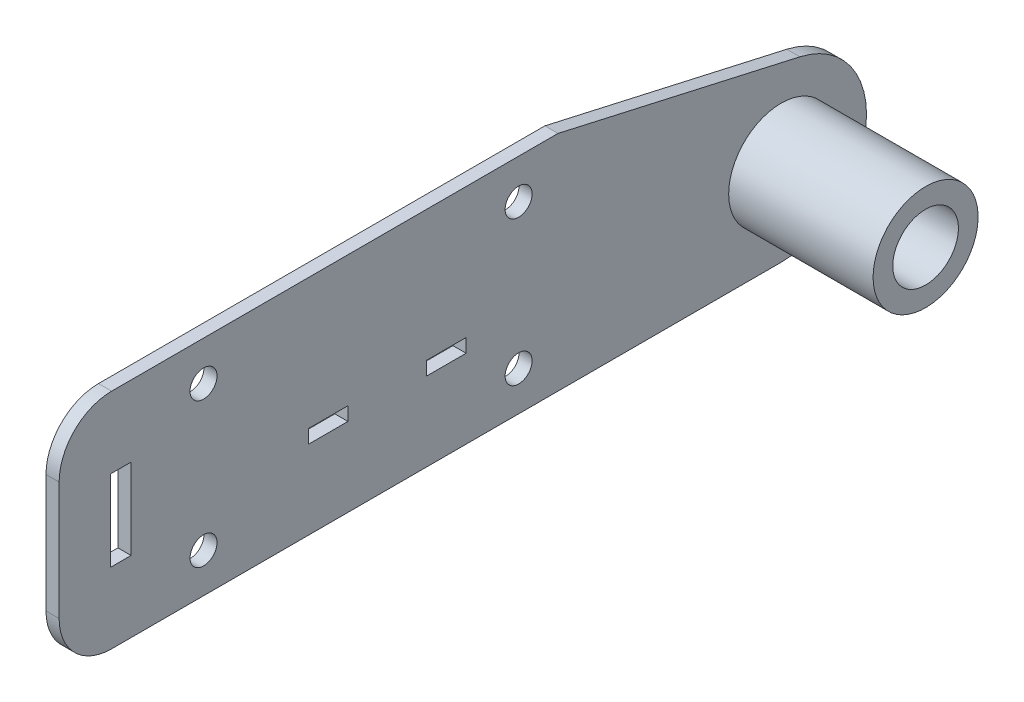
ISO-10303-21;
HEADER;
FILE_DESCRIPTION(('STEP AP214'),'2;1');
FILE_NAME('part.step','',(''),(''),'','','');
FILE_SCHEMA(('AUTOMOTIVE_DESIGN { 1 0 10303 214 1 1 1 1 }'));
ENDSEC;
DATA;
#1=APPLICATION_CONTEXT('core data for automotive mechanical design processes');
#2=APPLICATION_PROTOCOL_DEFINITION('international standard','automotive_design',2000,#1);
#3=PRODUCT_CONTEXT('',#1,'mechanical');
#4=PRODUCT('Part','Part','',(#3));
#5=PRODUCT_RELATED_PRODUCT_CATEGORY('part','',(#4));
#6=PRODUCT_DEFINITION_FORMATION('','',#4);
#7=PRODUCT_DEFINITION_CONTEXT('part definition',#1,'design');
#8=PRODUCT_DEFINITION('design','',#6,#7);
#9=PRODUCT_DEFINITION_SHAPE('','',#8);
#10=(LENGTH_UNIT() NAMED_UNIT(*) SI_UNIT(.MILLI.,.METRE.));
#11=(NAMED_UNIT(*) PLANE_ANGLE_UNIT() SI_UNIT($,.RADIAN.));
#12=(NAMED_UNIT(*) SI_UNIT($,.STERADIAN.) SOLID_ANGLE_UNIT());
#13=UNCERTAINTY_MEASURE_WITH_UNIT(LENGTH_MEASURE(1.E-05),#10,'distance_accuracy_value','');
#14=(GEOMETRIC_REPRESENTATION_CONTEXT(3) GLOBAL_UNCERTAINTY_ASSIGNED_CONTEXT((#13)) GLOBAL_UNIT_ASSIGNED_CONTEXT((#10,
#11,#12)) REPRESENTATION_CONTEXT('',''));
#15=CARTESIAN_POINT('',(0.,0.,0.));
#16=DIRECTION('',(0.,0.,1.));
#17=DIRECTION('',(1.,0.,0.));
#18=AXIS2_PLACEMENT_3D('',#15,#16,#17);
#19=CARTESIAN_POINT('',(3.175,-26.9875,0.));
#20=DIRECTION('',(0.,1.,0.));
#21=DIRECTION('',(0.,0.,1.));
#22=AXIS2_PLACEMENT_3D('',#19,#20,#21);
#23=PLANE('',#22);
#24=DIRECTION('',(0.,0.,-1.));
#25=VECTOR('',#24,1.);
#26=CARTESIAN_POINT('',(0.,-26.9875,0.));
#27=LINE('',#26,#25);
#28=CARTESIAN_POINT('',(0.,-26.9875,60.3249999999999));
#29=VERTEX_POINT('',#28);
#30=CARTESIAN_POINT('',(0.,-26.9875,-101.6));
#31=VERTEX_POINT('',#30);
#32=EDGE_CURVE('E434',#29,#31,#27,.T.);
#33=ORIENTED_EDGE('',*,*,#32,.T.);
#34=DIRECTION('',(-1.,0.,0.));
#35=VECTOR('',#34,1.);
#36=CARTESIAN_POINT('',(3.175,-26.9875,-101.6));
#37=LINE('',#36,#35);
#38=CARTESIAN_POINT('',(3.175,-26.9875,-101.6));
#39=VERTEX_POINT('',#38);
#40=EDGE_CURVE('E11',#39,#31,#37,.T.);
#41=ORIENTED_EDGE('',*,*,#40,.F.);
#42=DIRECTION('',(0.,0.,-1.));
#43=VECTOR('',#42,1.);
#44=CARTESIAN_POINT('',(3.175,-26.9875,0.));
#45=LINE('',#44,#43);
#46=CARTESIAN_POINT('',(3.175,-26.9875,60.3249999999999));
#47=VERTEX_POINT('',#46);
#48=EDGE_CURVE('E400',#47,#39,#45,.T.);
#49=ORIENTED_EDGE('',*,*,#48,.F.);
#50=DIRECTION('',(1.,0.,0.));
#51=VECTOR('',#50,1.);
#52=CARTESIAN_POINT('',(-59.6528341740776,-26.9875,60.3249999999999));
#53=LINE('',#52,#51);
#54=EDGE_CURVE('E361',#29,#47,#53,.T.);
#55=ORIENTED_EDGE('',*,*,#54,.F.);
#56=EDGE_LOOP('',(#33,#41,#49,#55));
#57=FACE_BOUND('',#56,.T.);
#58=ADVANCED_FACE('F44',(#57),#23,.F.);
#59=CARTESIAN_POINT('',(3.175,-6.35,-101.6));
#60=DIRECTION('',(-1.,0.,0.));
#61=DIRECTION('',(0.,0.,1.));
#62=AXIS2_PLACEMENT_3D('',#59,#60,#61);
#63=CYLINDRICAL_SURFACE('',#62,20.6375);
#64=CARTESIAN_POINT('',(0.,-6.35,-101.6));
#65=DIRECTION('',(1.,0.,0.));
#66=DIRECTION('',(0.,0.,-1.));
#67=AXIS2_PLACEMENT_3D('',#64,#65,#66);
#68=CIRCLE('',#67,20.6375);
#69=CARTESIAN_POINT('',(0.,13.7812178866127,-106.143178694673));
#70=VERTEX_POINT('',#69);
#71=EDGE_CURVE('E438',#31,#70,#68,.T.);
#72=ORIENTED_EDGE('',*,*,#71,.T.);
#73=DIRECTION('',(-1.,0.,0.));
#74=VECTOR('',#73,1.);
#75=CARTESIAN_POINT('',(3.175,13.7812178866127,-106.143178694673));
#76=LINE('',#75,#74);
#77=CARTESIAN_POINT('',(3.175,13.7812178866127,-106.143178694673));
#78=VERTEX_POINT('',#77);
#79=EDGE_CURVE('E53',#78,#70,#76,.T.);
#80=ORIENTED_EDGE('',*,*,#79,.F.);
#81=CARTESIAN_POINT('',(3.175,-6.35,-101.6));
#82=DIRECTION('',(1.,0.,0.));
#83=DIRECTION('',(0.,0.,-1.));
#84=AXIS2_PLACEMENT_3D('',#81,#82,#83);
#85=CIRCLE('',#84,20.6375);
#86=EDGE_CURVE('E404',#39,#78,#85,.T.);
#87=ORIENTED_EDGE('',*,*,#86,.F.);
#88=ORIENTED_EDGE('',*,*,#40,.T.);
#89=EDGE_LOOP('',(#72,#80,#87,#88));
#90=FACE_BOUND('',#89,.T.);
#91=ADVANCED_FACE('F456',(#90),#63,.T.);
#92=CARTESIAN_POINT('',(3.175,35.9066765211899,-8.10335711859988));
#93=DIRECTION('',(0.,0.97546785640764,-0.220141911310601));
#94=DIRECTION('',(0.,0.220141911310601,0.97546785640764));
#95=AXIS2_PLACEMENT_3D('',#92,#93,#94);
#96=PLANE('',#95);
#97=DIRECTION('',(0.,-0.220141911310601,-0.97546785640764));
#98=VECTOR('',#97,1.);
#99=CARTESIAN_POINT('',(0.,35.9066765211899,-8.10335711859988));
#100=LINE('',#99,#98);
#101=CARTESIAN_POINT('',(0.,26.9875,-47.625));
#102=VERTEX_POINT('',#101);
#103=EDGE_CURVE('E442',#102,#70,#100,.T.);
#104=ORIENTED_EDGE('',*,*,#103,.F.);
#105=DIRECTION('',(-1.,0.,0.));
#106=VECTOR('',#105,1.);
#107=CARTESIAN_POINT('',(3.175,26.9875,-47.625));
#108=LINE('',#107,#106);
#109=CARTESIAN_POINT('',(3.175,26.9875,-47.625));
#110=VERTEX_POINT('',#109);
#111=EDGE_CURVE('E419',#110,#102,#108,.T.);
#112=ORIENTED_EDGE('',*,*,#111,.F.);
#113=DIRECTION('',(0.,-0.220141911310601,-0.97546785640764));
#114=VECTOR('',#113,1.);
#115=CARTESIAN_POINT('',(3.175,35.9066765211899,-8.10335711859988));
#116=LINE('',#115,#114);
#117=EDGE_CURVE('E407',#110,#78,#116,.T.);
#118=ORIENTED_EDGE('',*,*,#117,.T.);
#119=ORIENTED_EDGE('',*,*,#79,.T.);
#120=EDGE_LOOP('',(#104,#112,#118,#119));
#121=FACE_BOUND('',#120,.T.);
#122=ADVANCED_FACE('F453',(#121),#96,.T.);
#123=CARTESIAN_POINT('',(3.175,26.9875,0.));
#124=DIRECTION('',(0.,1.,0.));
#125=DIRECTION('',(0.,0.,1.));
#126=AXIS2_PLACEMENT_3D('',#123,#124,#125);
#127=PLANE('',#126);
#128=DIRECTION('',(0.,0.,-1.));
#129=VECTOR('',#128,1.);
#130=CARTESIAN_POINT('',(0.,26.9875,0.));
#131=LINE('',#130,#129);
#132=CARTESIAN_POINT('',(0.,26.9875,60.3249999999999));
#133=VERTEX_POINT('',#132);
#134=EDGE_CURVE('E389',#133,#102,#131,.T.);
#135=ORIENTED_EDGE('',*,*,#134,.F.);
#136=DIRECTION('',(1.,0.,0.));
#137=VECTOR('',#136,1.);
#138=CARTESIAN_POINT('',(-59.6528341740776,26.9875,60.3249999999999));
#139=LINE('',#138,#137);
#140=CARTESIAN_POINT('',(3.175,26.9875,60.3249999999999));
#141=VERTEX_POINT('',#140);
#142=EDGE_CURVE('E360',#133,#141,#139,.T.);
#143=ORIENTED_EDGE('',*,*,#142,.T.);
#144=DIRECTION('',(0.,0.,-1.));
#145=VECTOR('',#144,1.);
#146=CARTESIAN_POINT('',(3.175,26.9875,0.));
#147=LINE('',#146,#145);
#148=EDGE_CURVE('E411',#141,#110,#147,.T.);
#149=ORIENTED_EDGE('',*,*,#148,.T.);
#150=ORIENTED_EDGE('',*,*,#111,.T.);
#151=EDGE_LOOP('',(#135,#143,#149,#150));
#152=FACE_BOUND('',#151,.T.);
#153=ADVANCED_FACE('F463',(#152),#127,.T.);
#154=CARTESIAN_POINT('',(3.175,17.4625,38.1));
#155=DIRECTION('',(-1.,0.,0.));
#156=DIRECTION('',(0.,0.,1.));
#157=AXIS2_PLACEMENT_3D('',#154,#155,#156);
#158=CYLINDRICAL_SURFACE('',#157,3.2639);
#159=CARTESIAN_POINT('',(3.175,17.4625,38.1));
#160=DIRECTION('',(1.,0.,0.));
#161=DIRECTION('',(0.,0.,-1.));
#162=AXIS2_PLACEMENT_3D('',#159,#160,#161);
#163=CIRCLE('',#162,3.2639);
#164=CARTESIAN_POINT('',(3.175,17.4625,34.8361));
#165=VERTEX_POINT('',#164);
#166=EDGE_CURVE('E396',#165,#165,#163,.T.);
#167=ORIENTED_EDGE('',*,*,#166,.T.);
#168=EDGE_LOOP('',(#167));
#169=FACE_BOUND('',#168,.T.);
#170=CARTESIAN_POINT('',(0.,17.4625,38.1));
#171=DIRECTION('',(1.,0.,0.));
#172=DIRECTION('',(0.,0.,-1.));
#173=AXIS2_PLACEMENT_3D('',#170,#171,#172);
#174=CIRCLE('',#173,3.2639);
#175=CARTESIAN_POINT('',(0.,17.4625,34.8361));
#176=VERTEX_POINT('',#175);
#177=EDGE_CURVE('E430',#176,#176,#174,.T.);
#178=ORIENTED_EDGE('',*,*,#177,.F.);
#179=EDGE_LOOP('',(#178));
#180=FACE_BOUND('',#179,.T.);
#181=ADVANCED_FACE('F501',(#169,#180),#158,.F.);
#182=CARTESIAN_POINT('',(3.175,17.4625,-38.1));
#183=DIRECTION('',(-1.,0.,0.));
#184=DIRECTION('',(0.,0.,1.));
#185=AXIS2_PLACEMENT_3D('',#182,#183,#184);
#186=CYLINDRICAL_SURFACE('',#185,3.2639);
#187=CARTESIAN_POINT('',(3.175,17.4625,-38.1));
#188=DIRECTION('',(1.,0.,0.));
#189=DIRECTION('',(0.,0.,-1.));
#190=AXIS2_PLACEMENT_3D('',#187,#188,#189);
#191=CIRCLE('',#190,3.2639);
#192=CARTESIAN_POINT('',(3.175,17.4625,-41.3639));
#193=VERTEX_POINT('',#192);
#194=EDGE_CURVE('E392',#193,#193,#191,.T.);
#195=ORIENTED_EDGE('',*,*,#194,.T.);
#196=EDGE_LOOP('',(#195));
#197=FACE_BOUND('',#196,.T.);
#198=CARTESIAN_POINT('',(0.,17.4625,-38.1));
#199=DIRECTION('',(1.,0.,0.));
#200=DIRECTION('',(0.,0.,-1.));
#201=AXIS2_PLACEMENT_3D('',#198,#199,#200);
#202=CIRCLE('',#201,3.2639);
#203=CARTESIAN_POINT('',(0.,17.4625,-41.3639));
#204=VERTEX_POINT('',#203);
#205=EDGE_CURVE('E426',#204,#204,#202,.T.);
#206=ORIENTED_EDGE('',*,*,#205,.F.);
#207=EDGE_LOOP('',(#206));
#208=FACE_BOUND('',#207,.T.);
#209=ADVANCED_FACE('F504',(#197,#208),#186,.F.);
#210=CARTESIAN_POINT('',(3.175,-17.4625,38.1));
#211=DIRECTION('',(-1.,0.,0.));
#212=DIRECTION('',(0.,0.,1.));
#213=AXIS2_PLACEMENT_3D('',#210,#211,#212);
#214=CYLINDRICAL_SURFACE('',#213,3.2639);
#215=CARTESIAN_POINT('',(3.175,-17.4625,38.1));
#216=DIRECTION('',(1.,0.,0.));
#217=DIRECTION('',(0.,0.,-1.));
#218=AXIS2_PLACEMENT_3D('',#215,#216,#217);
#219=CIRCLE('',#218,3.2639);
#220=CARTESIAN_POINT('',(3.175,-17.4625,34.8361));
#221=VERTEX_POINT('',#220);
#222=EDGE_CURVE('E388',#221,#221,#219,.T.);
#223=ORIENTED_EDGE('',*,*,#222,.T.);
#224=EDGE_LOOP('',(#223));
#225=FACE_BOUND('',#224,.T.);
#226=CARTESIAN_POINT('',(0.,-17.4625,38.1));
#227=DIRECTION('',(1.,0.,0.));
#228=DIRECTION('',(0.,0.,-1.));
#229=AXIS2_PLACEMENT_3D('',#226,#227,#228);
#230=CIRCLE('',#229,3.2639);
#231=CARTESIAN_POINT('',(0.,-17.4625,34.8361));
#232=VERTEX_POINT('',#231);
#233=EDGE_CURVE('E423',#232,#232,#230,.T.);
#234=ORIENTED_EDGE('',*,*,#233,.F.);
#235=EDGE_LOOP('',(#234));
#236=FACE_BOUND('',#235,.T.);
#237=ADVANCED_FACE('F507',(#225,#236),#214,.F.);
#238=CARTESIAN_POINT('',(3.175,-17.4625,-38.1));
#239=DIRECTION('',(-1.,0.,0.));
#240=DIRECTION('',(0.,0.,1.));
#241=AXIS2_PLACEMENT_3D('',#238,#239,#240);
#242=CYLINDRICAL_SURFACE('',#241,3.2639);
#243=CARTESIAN_POINT('',(3.175,-17.4625,-38.1));
#244=DIRECTION('',(1.,0.,0.));
#245=DIRECTION('',(0.,0.,-1.));
#246=AXIS2_PLACEMENT_3D('',#243,#244,#245);
#247=CIRCLE('',#246,3.2639);
#248=CARTESIAN_POINT('',(3.175,-17.4625,-41.3639));
#249=VERTEX_POINT('',#248);
#250=EDGE_CURVE('E384',#249,#249,#247,.T.);
#251=ORIENTED_EDGE('',*,*,#250,.T.);
#252=EDGE_LOOP('',(#251));
#253=FACE_BOUND('',#252,.T.);
#254=CARTESIAN_POINT('',(0.,-17.4625,-38.1));
#255=DIRECTION('',(1.,0.,0.));
#256=DIRECTION('',(0.,0.,-1.));
#257=AXIS2_PLACEMENT_3D('',#254,#255,#256);
#258=CIRCLE('',#257,3.2639);
#259=CARTESIAN_POINT('',(0.,-17.4625,-41.3639));
#260=VERTEX_POINT('',#259);
#261=EDGE_CURVE('E383',#260,#260,#258,.T.);
#262=ORIENTED_EDGE('',*,*,#261,.F.);
#263=EDGE_LOOP('',(#262));
#264=FACE_BOUND('',#263,.T.);
#265=ADVANCED_FACE('F46',(#253,#264),#242,.F.);
#266=CARTESIAN_POINT('',(3.175,0.,0.));
#267=DIRECTION('',(1.,0.,0.));
#268=DIRECTION('',(0.,0.,-1.));
#269=AXIS2_PLACEMENT_3D('',#266,#267,#268);
#270=PLANE('',#269);
#271=DIRECTION('',(0.,-1.,0.));
#272=VECTOR('',#271,1.);
#273=CARTESIAN_POINT('',(3.175,-4.6355,12.7));
#274=LINE('',#273,#272);
#275=CARTESIAN_POINT('',(3.175,-4.6355,12.7));
#276=VERTEX_POINT('',#275);
#277=CARTESIAN_POINT('',(3.175,-7.9375,12.7));
#278=VERTEX_POINT('',#277);
#279=EDGE_CURVE('E63',#276,#278,#274,.T.);
#280=ORIENTED_EDGE('',*,*,#279,.F.);
#281=DIRECTION('',(0.,0.,1.));
#282=VECTOR('',#281,1.);
#283=CARTESIAN_POINT('',(3.175,-4.6355,12.7));
#284=LINE('',#283,#282);
#285=CARTESIAN_POINT('',(3.175,-4.6355,3.175));
#286=VERTEX_POINT('',#285);
#287=EDGE_CURVE('E227',#286,#276,#284,.T.);
#288=ORIENTED_EDGE('',*,*,#287,.F.);
#289=DIRECTION('',(0.,1.,0.));
#290=VECTOR('',#289,1.);
#291=CARTESIAN_POINT('',(3.175,-4.6355,3.175));
#292=LINE('',#291,#290);
#293=CARTESIAN_POINT('',(3.175,-7.9375,3.175));
#294=VERTEX_POINT('',#293);
#295=EDGE_CURVE('E233',#294,#286,#292,.T.);
#296=ORIENTED_EDGE('',*,*,#295,.F.);
#297=DIRECTION('',(0.,0.,-1.));
#298=VECTOR('',#297,1.);
#299=CARTESIAN_POINT('',(3.175,-7.9375,12.7));
#300=LINE('',#299,#298);
#301=EDGE_CURVE('E241',#278,#294,#300,.T.);
#302=ORIENTED_EDGE('',*,*,#301,.F.);
#303=EDGE_LOOP('',(#280,#288,#296,#302));
#304=FACE_BOUND('',#303,.T.);
#305=DIRECTION('',(0.,-1.,0.));
#306=VECTOR('',#305,1.);
#307=CARTESIAN_POINT('',(3.175,-4.6355,-15.875));
#308=LINE('',#307,#306);
#309=CARTESIAN_POINT('',(3.175,-4.6355,-15.875));
#310=VERTEX_POINT('',#309);
#311=CARTESIAN_POINT('',(3.175,-7.9375,-15.875));
#312=VERTEX_POINT('',#311);
#313=EDGE_CURVE('E249',#310,#312,#308,.T.);
#314=ORIENTED_EDGE('',*,*,#313,.F.);
#315=DIRECTION('',(0.,0.,1.));
#316=VECTOR('',#315,1.);
#317=CARTESIAN_POINT('',(3.175,-4.6355,-15.875));
#318=LINE('',#317,#316);
#319=CARTESIAN_POINT('',(3.175,-4.6355,-25.4));
#320=VERTEX_POINT('',#319);
#321=EDGE_CURVE('E260',#320,#310,#318,.T.);
#322=ORIENTED_EDGE('',*,*,#321,.F.);
#323=DIRECTION('',(0.,1.,0.));
#324=VECTOR('',#323,1.);
#325=CARTESIAN_POINT('',(3.175,-4.6355,-25.4));
#326=LINE('',#325,#324);
#327=CARTESIAN_POINT('',(3.175,-7.9375,-25.4));
#328=VERTEX_POINT('',#327);
#329=EDGE_CURVE('E279',#328,#320,#326,.T.);
#330=ORIENTED_EDGE('',*,*,#329,.F.);
#331=DIRECTION('',(0.,0.,-1.));
#332=VECTOR('',#331,1.);
#333=CARTESIAN_POINT('',(3.175,-7.9375,-15.875));
#334=LINE('',#333,#332);
#335=EDGE_CURVE('E275',#312,#328,#334,.T.);
#336=ORIENTED_EDGE('',*,*,#335,.F.);
#337=EDGE_LOOP('',(#314,#322,#330,#336));
#338=FACE_BOUND('',#337,.T.);
#339=ORIENTED_EDGE('',*,*,#250,.F.);
#340=EDGE_LOOP('',(#339));
#341=FACE_BOUND('',#340,.T.);
#342=ORIENTED_EDGE('',*,*,#222,.F.);
#343=EDGE_LOOP('',(#342));
#344=FACE_BOUND('',#343,.T.);
#345=ORIENTED_EDGE('',*,*,#194,.F.);
#346=EDGE_LOOP('',(#345));
#347=FACE_BOUND('',#346,.T.);
#348=ORIENTED_EDGE('',*,*,#166,.F.);
#349=EDGE_LOOP('',(#348));
#350=FACE_BOUND('',#349,.T.);
#351=ORIENTED_EDGE('',*,*,#48,.T.);
#352=ORIENTED_EDGE('',*,*,#86,.T.);
#353=ORIENTED_EDGE('',*,*,#117,.F.);
#354=ORIENTED_EDGE('',*,*,#148,.F.);
#355=CARTESIAN_POINT('',(3.175,14.2875,60.325));
#356=DIRECTION('',(1.,0.,0.));
#357=DIRECTION('',(0.,0.,-1.));
#358=AXIS2_PLACEMENT_3D('',#355,#356,#357);
#359=CIRCLE('',#358,12.7);
#360=CARTESIAN_POINT('',(3.175,14.2874999999999,73.025));
#361=VERTEX_POINT('',#360);
#362=EDGE_CURVE('E341',#141,#361,#359,.T.);
#363=ORIENTED_EDGE('',*,*,#362,.T.);
#364=DIRECTION('',(0.,-1.,0.));
#365=VECTOR('',#364,1.);
#366=CARTESIAN_POINT('',(3.175,14.2874999999999,73.025));
#367=LINE('',#366,#365);
#368=CARTESIAN_POINT('',(3.175,-14.2874999999999,73.025));
#369=VERTEX_POINT('',#368);
#370=EDGE_CURVE('E353',#361,#369,#367,.T.);
#371=ORIENTED_EDGE('',*,*,#370,.T.);
#372=CARTESIAN_POINT('',(3.175,-14.2875,60.325));
#373=DIRECTION('',(1.,0.,0.));
#374=DIRECTION('',(0.,0.,1.));
#375=AXIS2_PLACEMENT_3D('',#372,#373,#374);
#376=CIRCLE('',#375,12.7);
#377=EDGE_CURVE('E357',#369,#47,#376,.T.);
#378=ORIENTED_EDGE('',*,*,#377,.T.);
#379=EDGE_LOOP('',(#351,#352,#353,#354,#363,#371,#378));
#380=FACE_BOUND('',#379,.T.);
#381=CARTESIAN_POINT('',(3.175,-6.35,-101.6));
#382=DIRECTION('',(1.,0.,0.));
#383=DIRECTION('',(0.,0.,-1.));
#384=AXIS2_PLACEMENT_3D('',#381,#382,#383);
#385=CIRCLE('',#384,12.7);
#386=CARTESIAN_POINT('',(3.175,-6.35,-114.3));
#387=VERTEX_POINT('',#386);
#388=EDGE_CURVE('E415',#387,#387,#385,.T.);
#389=ORIENTED_EDGE('',*,*,#388,.F.);
#390=EDGE_LOOP('',(#389));
#391=FACE_BOUND('',#390,.T.);
#392=DIRECTION('',(0.,0.,-1.));
#393=VECTOR('',#392,1.);
#394=CARTESIAN_POINT('',(3.175,-9.77900000000001,60.579));
#395=LINE('',#394,#393);
#396=CARTESIAN_POINT('',(3.175,-9.77900000000001,60.579));
#397=VERTEX_POINT('',#396);
#398=CARTESIAN_POINT('',(3.175,-9.77900000000001,55.626));
#399=VERTEX_POINT('',#398);
#400=EDGE_CURVE('E325',#397,#399,#395,.T.);
#401=ORIENTED_EDGE('',*,*,#400,.F.);
#402=DIRECTION('',(0.,-1.,0.));
#403=VECTOR('',#402,1.);
#404=CARTESIAN_POINT('',(3.175,9.77899999999999,60.579));
#405=LINE('',#404,#403);
#406=CARTESIAN_POINT('',(3.175,9.77899999999999,60.579));
#407=VERTEX_POINT('',#406);
#408=EDGE_CURVE('E289',#407,#397,#405,.T.);
#409=ORIENTED_EDGE('',*,*,#408,.F.);
#410=DIRECTION('',(0.,0.,1.));
#411=VECTOR('',#410,1.);
#412=CARTESIAN_POINT('',(3.175,9.77899999999999,60.579));
#413=LINE('',#412,#411);
#414=CARTESIAN_POINT('',(3.175,9.77899999999999,55.626));
#415=VERTEX_POINT('',#414);
#416=EDGE_CURVE('E333',#415,#407,#413,.T.);
#417=ORIENTED_EDGE('',*,*,#416,.F.);
#418=DIRECTION('',(0.,1.,0.));
#419=VECTOR('',#418,1.);
#420=CARTESIAN_POINT('',(3.175,9.77899999999999,55.626));
#421=LINE('',#420,#419);
#422=EDGE_CURVE('E329',#399,#415,#421,.T.);
#423=ORIENTED_EDGE('',*,*,#422,.F.);
#424=EDGE_LOOP('',(#401,#409,#417,#423));
#425=FACE_BOUND('',#424,.T.);
#426=ADVANCED_FACE('F466',(#304,#338,#341,#344,#347,#350,#380,#391,#425),#270,.T.);
#427=CARTESIAN_POINT('',(0.,0.,0.));
#428=DIRECTION('',(1.,0.,0.));
#429=DIRECTION('',(0.,0.,-1.));
#430=AXIS2_PLACEMENT_3D('',#427,#428,#429);
#431=PLANE('',#430);
#432=DIRECTION('',(0.,0.,1.));
#433=VECTOR('',#432,1.);
#434=CARTESIAN_POINT('',(0.,-4.6355,12.7));
#435=LINE('',#434,#433);
#436=CARTESIAN_POINT('',(0.,-4.6355,3.175));
#437=VERTEX_POINT('',#436);
#438=CARTESIAN_POINT('',(0.,-4.6355,12.7));
#439=VERTEX_POINT('',#438);
#440=EDGE_CURVE('E215',#437,#439,#435,.T.);
#441=ORIENTED_EDGE('',*,*,#440,.T.);
#442=DIRECTION('',(0.,-1.,0.));
#443=VECTOR('',#442,1.);
#444=CARTESIAN_POINT('',(0.,-4.6355,12.7));
#445=LINE('',#444,#443);
#446=CARTESIAN_POINT('',(0.,-7.9375,12.7));
#447=VERTEX_POINT('',#446);
#448=EDGE_CURVE('E208',#439,#447,#445,.T.);
#449=ORIENTED_EDGE('',*,*,#448,.T.);
#450=DIRECTION('',(0.,0.,-1.));
#451=VECTOR('',#450,1.);
#452=CARTESIAN_POINT('',(0.,-7.9375,12.7));
#453=LINE('',#452,#451);
#454=CARTESIAN_POINT('',(0.,-7.9375,3.175));
#455=VERTEX_POINT('',#454);
#456=EDGE_CURVE('E218',#447,#455,#453,.T.);
#457=ORIENTED_EDGE('',*,*,#456,.T.);
#458=DIRECTION('',(0.,1.,0.));
#459=VECTOR('',#458,1.);
#460=CARTESIAN_POINT('',(0.,-4.6355,3.175));
#461=LINE('',#460,#459);
#462=EDGE_CURVE('E74',#455,#437,#461,.T.);
#463=ORIENTED_EDGE('',*,*,#462,.T.);
#464=EDGE_LOOP('',(#441,#449,#457,#463));
#465=FACE_BOUND('',#464,.T.);
#466=DIRECTION('',(0.,0.,1.));
#467=VECTOR('',#466,1.);
#468=CARTESIAN_POINT('',(0.,-4.6355,-15.875));
#469=LINE('',#468,#467);
#470=CARTESIAN_POINT('',(0.,-4.6355,-25.4));
#471=VERTEX_POINT('',#470);
#472=CARTESIAN_POINT('',(0.,-4.6355,-15.875));
#473=VERTEX_POINT('',#472);
#474=EDGE_CURVE('E268',#471,#473,#469,.T.);
#475=ORIENTED_EDGE('',*,*,#474,.T.);
#476=DIRECTION('',(0.,-1.,0.));
#477=VECTOR('',#476,1.);
#478=CARTESIAN_POINT('',(0.,-4.6355,-15.875));
#479=LINE('',#478,#477);
#480=CARTESIAN_POINT('',(0.,-7.9375,-15.875));
#481=VERTEX_POINT('',#480);
#482=EDGE_CURVE('E255',#473,#481,#479,.T.);
#483=ORIENTED_EDGE('',*,*,#482,.T.);
#484=DIRECTION('',(0.,0.,-1.));
#485=VECTOR('',#484,1.);
#486=CARTESIAN_POINT('',(0.,-7.9375,-15.875));
#487=LINE('',#486,#485);
#488=CARTESIAN_POINT('',(0.,-7.9375,-25.4));
#489=VERTEX_POINT('',#488);
#490=EDGE_CURVE('E259',#481,#489,#487,.T.);
#491=ORIENTED_EDGE('',*,*,#490,.T.);
#492=DIRECTION('',(0.,1.,0.));
#493=VECTOR('',#492,1.);
#494=CARTESIAN_POINT('',(0.,-4.6355,-25.4));
#495=LINE('',#494,#493);
#496=EDGE_CURVE('E264',#489,#471,#495,.T.);
#497=ORIENTED_EDGE('',*,*,#496,.T.);
#498=EDGE_LOOP('',(#475,#483,#491,#497));
#499=FACE_BOUND('',#498,.T.);
#500=ORIENTED_EDGE('',*,*,#261,.T.);
#501=EDGE_LOOP('',(#500));
#502=FACE_BOUND('',#501,.T.);
#503=ORIENTED_EDGE('',*,*,#233,.T.);
#504=EDGE_LOOP('',(#503));
#505=FACE_BOUND('',#504,.T.);
#506=ORIENTED_EDGE('',*,*,#205,.T.);
#507=EDGE_LOOP('',(#506));
#508=FACE_BOUND('',#507,.T.);
#509=ORIENTED_EDGE('',*,*,#177,.T.);
#510=EDGE_LOOP('',(#509));
#511=FACE_BOUND('',#510,.T.);
#512=ORIENTED_EDGE('',*,*,#32,.F.);
#513=CARTESIAN_POINT('',(0.,-14.2875,60.325));
#514=DIRECTION('',(1.,0.,0.));
#515=DIRECTION('',(0.,0.,-1.));
#516=AXIS2_PLACEMENT_3D('',#513,#514,#515);
#517=CIRCLE('',#516,12.7);
#518=CARTESIAN_POINT('',(0.,-14.2874999999999,73.025));
#519=VERTEX_POINT('',#518);
#520=EDGE_CURVE('E312',#29,#519,#517,.F.);
#521=ORIENTED_EDGE('',*,*,#520,.T.);
#522=DIRECTION('',(0.,1.,0.));
#523=VECTOR('',#522,1.);
#524=CARTESIAN_POINT('',(0.,14.2874999999999,73.025));
#525=LINE('',#524,#523);
#526=CARTESIAN_POINT('',(0.,14.2874999999999,73.025));
#527=VERTEX_POINT('',#526);
#528=EDGE_CURVE('E317',#519,#527,#525,.T.);
#529=ORIENTED_EDGE('',*,*,#528,.T.);
#530=CARTESIAN_POINT('',(0.,14.2875,60.325));
#531=DIRECTION('',(1.,0.,0.));
#532=DIRECTION('',(0.,0.,-1.));
#533=AXIS2_PLACEMENT_3D('',#530,#531,#532);
#534=CIRCLE('',#533,12.7);
#535=EDGE_CURVE('E313',#527,#133,#534,.F.);
#536=ORIENTED_EDGE('',*,*,#535,.T.);
#537=ORIENTED_EDGE('',*,*,#134,.T.);
#538=ORIENTED_EDGE('',*,*,#103,.T.);
#539=ORIENTED_EDGE('',*,*,#71,.F.);
#540=EDGE_LOOP('',(#512,#521,#529,#536,#537,#538,#539));
#541=FACE_BOUND('',#540,.T.);
#542=CARTESIAN_POINT('',(0.,-6.35,-101.6));
#543=DIRECTION('',(-1.,0.,0.));
#544=DIRECTION('',(0.,0.,1.));
#545=AXIS2_PLACEMENT_3D('',#542,#543,#544);
#546=CIRCLE('',#545,7.93749999999999);
#547=CARTESIAN_POINT('',(0.,-6.35,-93.6625));
#548=VERTEX_POINT('',#547);
#549=EDGE_CURVE('E303',#548,#548,#546,.T.);
#550=ORIENTED_EDGE('',*,*,#549,.F.);
#551=EDGE_LOOP('',(#550));
#552=FACE_BOUND('',#551,.T.);
#553=DIRECTION('',(0.,0.,1.));
#554=VECTOR('',#553,1.);
#555=CARTESIAN_POINT('',(0.,-9.77900000000001,60.579));
#556=LINE('',#555,#554);
#557=CARTESIAN_POINT('',(0.,-9.77900000000001,55.626));
#558=VERTEX_POINT('',#557);
#559=CARTESIAN_POINT('',(0.,-9.77900000000001,60.579));
#560=VERTEX_POINT('',#559);
#561=EDGE_CURVE('E318',#558,#560,#556,.T.);
#562=ORIENTED_EDGE('',*,*,#561,.F.);
#563=DIRECTION('',(0.,-1.,0.));
#564=VECTOR('',#563,1.);
#565=CARTESIAN_POINT('',(0.,9.77899999999999,55.626));
#566=LINE('',#565,#564);
#567=CARTESIAN_POINT('',(0.,9.77899999999999,55.626));
#568=VERTEX_POINT('',#567);
#569=EDGE_CURVE('E299',#568,#558,#566,.T.);
#570=ORIENTED_EDGE('',*,*,#569,.F.);
#571=DIRECTION('',(0.,0.,-1.));
#572=VECTOR('',#571,1.);
#573=CARTESIAN_POINT('',(0.,9.77899999999999,60.579));
#574=LINE('',#573,#572);
#575=CARTESIAN_POINT('',(0.,9.77899999999999,60.579));
#576=VERTEX_POINT('',#575);
#577=EDGE_CURVE('E304',#576,#568,#574,.T.);
#578=ORIENTED_EDGE('',*,*,#577,.F.);
#579=DIRECTION('',(0.,1.,0.));
#580=VECTOR('',#579,1.);
#581=CARTESIAN_POINT('',(0.,9.77899999999999,60.579));
#582=LINE('',#581,#580);
#583=EDGE_CURVE('E308',#560,#576,#582,.T.);
#584=ORIENTED_EDGE('',*,*,#583,.F.);
#585=EDGE_LOOP('',(#562,#570,#578,#584));
#586=FACE_BOUND('',#585,.T.);
#587=ADVANCED_FACE('F223',(#465,#499,#502,#505,#508,#511,#541,#552,#586),#431,.F.);
#588=CARTESIAN_POINT('',(38.1,-6.35,-101.6));
#589=DIRECTION('',(-1.,0.,0.));
#590=DIRECTION('',(0.,0.,1.));
#591=AXIS2_PLACEMENT_3D('',#588,#589,#590);
#592=CYLINDRICAL_SURFACE('',#591,12.7);
#593=ORIENTED_EDGE('',*,*,#388,.T.);
#594=EDGE_LOOP('',(#593));
#595=FACE_BOUND('',#594,.T.);
#596=CARTESIAN_POINT('',(38.1,-6.35,-101.6));
#597=DIRECTION('',(-1.,0.,0.));
#598=DIRECTION('',(0.,0.,1.));
#599=AXIS2_PLACEMENT_3D('',#596,#597,#598);
#600=CIRCLE('',#599,12.7);
#601=CARTESIAN_POINT('',(38.1,-6.35,-88.9));
#602=VERTEX_POINT('',#601);
#603=EDGE_CURVE('E377',#602,#602,#600,.T.);
#604=ORIENTED_EDGE('',*,*,#603,.T.);
#605=EDGE_LOOP('',(#604));
#606=FACE_BOUND('',#605,.T.);
#607=ADVANCED_FACE('F521',(#595,#606),#592,.T.);
#608=CARTESIAN_POINT('',(38.1,-6.35,-101.6));
#609=DIRECTION('',(-1.,0.,0.));
#610=DIRECTION('',(0.,0.,1.));
#611=AXIS2_PLACEMENT_3D('',#608,#609,#610);
#612=PLANE('',#611);
#613=CARTESIAN_POINT('',(38.1,-6.35,-101.6));
#614=DIRECTION('',(-1.,0.,0.));
#615=DIRECTION('',(0.,0.,1.));
#616=AXIS2_PLACEMENT_3D('',#613,#614,#615);
#617=CIRCLE('',#616,7.93749999999999);
#618=CARTESIAN_POINT('',(38.1,-6.35,-93.6625));
#619=VERTEX_POINT('',#618);
#620=EDGE_CURVE('E374',#619,#619,#617,.T.);
#621=ORIENTED_EDGE('',*,*,#620,.T.);
#622=EDGE_LOOP('',(#621));
#623=FACE_BOUND('',#622,.T.);
#624=ORIENTED_EDGE('',*,*,#603,.F.);
#625=EDGE_LOOP('',(#624));
#626=FACE_BOUND('',#625,.T.);
#627=ADVANCED_FACE('F490',(#623,#626),#612,.F.);
#628=CARTESIAN_POINT('',(38.1,-6.35,-101.6));
#629=DIRECTION('',(-1.,0.,0.));
#630=DIRECTION('',(0.,0.,1.));
#631=AXIS2_PLACEMENT_3D('',#628,#629,#630);
#632=CYLINDRICAL_SURFACE('',#631,7.93749999999999);
#633=ORIENTED_EDGE('',*,*,#620,.F.);
#634=EDGE_LOOP('',(#633));
#635=FACE_BOUND('',#634,.T.);
#636=ORIENTED_EDGE('',*,*,#549,.T.);
#637=EDGE_LOOP('',(#636));
#638=FACE_BOUND('',#637,.T.);
#639=ADVANCED_FACE('F483',(#635,#638),#632,.F.);
#640=CARTESIAN_POINT('',(-59.6528341740776,14.2875,60.325));
#641=DIRECTION('',(1.,0.,0.));
#642=DIRECTION('',(0.,0.,-1.));
#643=AXIS2_PLACEMENT_3D('',#640,#641,#642);
#644=CYLINDRICAL_SURFACE('',#643,12.7);
#645=ORIENTED_EDGE('',*,*,#535,.F.);
#646=DIRECTION('',(1.,0.,0.));
#647=VECTOR('',#646,1.);
#648=CARTESIAN_POINT('',(-59.6528341740776,14.2874999999999,73.025));
#649=LINE('',#648,#647);
#650=EDGE_CURVE('E366',#527,#361,#649,.T.);
#651=ORIENTED_EDGE('',*,*,#650,.T.);
#652=ORIENTED_EDGE('',*,*,#362,.F.);
#653=ORIENTED_EDGE('',*,*,#142,.F.);
#654=EDGE_LOOP('',(#645,#651,#652,#653));
#655=FACE_BOUND('',#654,.T.);
#656=ADVANCED_FACE('F481',(#655),#644,.T.);
#657=CARTESIAN_POINT('',(-59.6528341740776,14.2874999999999,73.025));
#658=DIRECTION('',(0.,0.,1.));
#659=DIRECTION('',(1.,0.,0.));
#660=AXIS2_PLACEMENT_3D('',#657,#658,#659);
#661=PLANE('',#660);
#662=ORIENTED_EDGE('',*,*,#528,.F.);
#663=DIRECTION('',(1.,0.,0.));
#664=VECTOR('',#663,1.);
#665=CARTESIAN_POINT('',(-59.6528341740776,-14.2874999999999,73.025));
#666=LINE('',#665,#664);
#667=EDGE_CURVE('E364',#519,#369,#666,.T.);
#668=ORIENTED_EDGE('',*,*,#667,.T.);
#669=ORIENTED_EDGE('',*,*,#370,.F.);
#670=ORIENTED_EDGE('',*,*,#650,.F.);
#671=EDGE_LOOP('',(#662,#668,#669,#670));
#672=FACE_BOUND('',#671,.T.);
#673=ADVANCED_FACE('F478',(#672),#661,.T.);
#674=CARTESIAN_POINT('',(-59.6528341740776,-14.2875,60.325));
#675=DIRECTION('',(1.,0.,0.));
#676=DIRECTION('',(0.,0.,-1.));
#677=AXIS2_PLACEMENT_3D('',#674,#675,#676);
#678=CYLINDRICAL_SURFACE('',#677,12.7);
#679=ORIENTED_EDGE('',*,*,#520,.F.);
#680=ORIENTED_EDGE('',*,*,#54,.T.);
#681=ORIENTED_EDGE('',*,*,#377,.F.);
#682=ORIENTED_EDGE('',*,*,#667,.F.);
#683=EDGE_LOOP('',(#679,#680,#681,#682));
#684=FACE_BOUND('',#683,.T.);
#685=ADVANCED_FACE('F475',(#684),#678,.T.);
#686=CARTESIAN_POINT('',(-59.6528341740776,-9.77900000000001,60.579));
#687=DIRECTION('',(0.,-1.,0.));
#688=DIRECTION('',(0.,0.,-1.));
#689=AXIS2_PLACEMENT_3D('',#686,#687,#688);
#690=PLANE('',#689);
#691=DIRECTION('',(1.,0.,0.));
#692=VECTOR('',#691,1.);
#693=CARTESIAN_POINT('',(-59.6528341740776,-9.77900000000001,55.626));
#694=LINE('',#693,#692);
#695=EDGE_CURVE('E345',#558,#399,#694,.T.);
#696=ORIENTED_EDGE('',*,*,#695,.F.);
#697=ORIENTED_EDGE('',*,*,#561,.T.);
#698=DIRECTION('',(1.,0.,0.));
#699=VECTOR('',#698,1.);
#700=CARTESIAN_POINT('',(-59.6528341740776,-9.77900000000001,60.579));
#701=LINE('',#700,#699);
#702=EDGE_CURVE('E337',#560,#397,#701,.T.);
#703=ORIENTED_EDGE('',*,*,#702,.T.);
#704=ORIENTED_EDGE('',*,*,#400,.T.);
#705=EDGE_LOOP('',(#696,#697,#703,#704));
#706=FACE_BOUND('',#705,.T.);
#707=ADVANCED_FACE('F620',(#706),#690,.F.);
#708=CARTESIAN_POINT('',(-59.6528341740776,9.77899999999999,55.626));
#709=DIRECTION('',(0.,0.,-1.));
#710=DIRECTION('',(0.,1.,0.));
#711=AXIS2_PLACEMENT_3D('',#708,#709,#710);
#712=PLANE('',#711);
#713=DIRECTION('',(1.,0.,0.));
#714=VECTOR('',#713,1.);
#715=CARTESIAN_POINT('',(-59.6528341740776,9.77899999999999,55.626));
#716=LINE('',#715,#714);
#717=EDGE_CURVE('E342',#568,#415,#716,.T.);
#718=ORIENTED_EDGE('',*,*,#717,.F.);
#719=ORIENTED_EDGE('',*,*,#569,.T.);
#720=ORIENTED_EDGE('',*,*,#695,.T.);
#721=ORIENTED_EDGE('',*,*,#422,.T.);
#722=EDGE_LOOP('',(#718,#719,#720,#721));
#723=FACE_BOUND('',#722,.T.);
#724=ADVANCED_FACE('F629',(#723),#712,.F.);
#725=CARTESIAN_POINT('',(-59.6528341740776,9.77899999999999,60.579));
#726=DIRECTION('',(0.,1.,0.));
#727=DIRECTION('',(0.,0.,1.));
#728=AXIS2_PLACEMENT_3D('',#725,#726,#727);
#729=PLANE('',#728);
#730=DIRECTION('',(1.,0.,0.));
#731=VECTOR('',#730,1.);
#732=CARTESIAN_POINT('',(-59.6528341740776,9.77899999999999,60.579));
#733=LINE('',#732,#731);
#734=EDGE_CURVE('E338',#576,#407,#733,.T.);
#735=ORIENTED_EDGE('',*,*,#734,.F.);
#736=ORIENTED_EDGE('',*,*,#577,.T.);
#737=ORIENTED_EDGE('',*,*,#717,.T.);
#738=ORIENTED_EDGE('',*,*,#416,.T.);
#739=EDGE_LOOP('',(#735,#736,#737,#738));
#740=FACE_BOUND('',#739,.T.);
#741=ADVANCED_FACE('F639',(#740),#729,.F.);
#742=CARTESIAN_POINT('',(-59.6528341740776,9.77899999999999,60.579));
#743=DIRECTION('',(0.,0.,1.));
#744=DIRECTION('',(0.,-1.,0.));
#745=AXIS2_PLACEMENT_3D('',#742,#743,#744);
#746=PLANE('',#745);
#747=ORIENTED_EDGE('',*,*,#702,.F.);
#748=ORIENTED_EDGE('',*,*,#583,.T.);
#749=ORIENTED_EDGE('',*,*,#734,.T.);
#750=ORIENTED_EDGE('',*,*,#408,.T.);
#751=EDGE_LOOP('',(#747,#748,#749,#750));
#752=FACE_BOUND('',#751,.T.);
#753=ADVANCED_FACE('F649',(#752),#746,.F.);
#754=CARTESIAN_POINT('',(0.,-4.6355,-15.875));
#755=DIRECTION('',(0.,0.,1.));
#756=DIRECTION('',(1.,0.,0.));
#757=AXIS2_PLACEMENT_3D('',#754,#755,#756);
#758=PLANE('',#757);
#759=ORIENTED_EDGE('',*,*,#313,.T.);
#760=DIRECTION('',(1.,0.,0.));
#761=VECTOR('',#760,1.);
#762=CARTESIAN_POINT('',(0.,-7.9375,-15.875));
#763=LINE('',#762,#761);
#764=EDGE_CURVE('E272',#481,#312,#763,.T.);
#765=ORIENTED_EDGE('',*,*,#764,.F.);
#766=ORIENTED_EDGE('',*,*,#482,.F.);
#767=DIRECTION('',(1.,0.,0.));
#768=VECTOR('',#767,1.);
#769=CARTESIAN_POINT('',(0.,-4.6355,-15.875));
#770=LINE('',#769,#768);
#771=EDGE_CURVE('E286',#473,#310,#770,.T.);
#772=ORIENTED_EDGE('',*,*,#771,.T.);
#773=EDGE_LOOP('',(#759,#765,#766,#772));
#774=FACE_BOUND('',#773,.T.);
#775=ADVANCED_FACE('F659',(#774),#758,.F.);
#776=CARTESIAN_POINT('',(0.,-4.6355,-15.875));
#777=DIRECTION('',(0.,1.,0.));
#778=DIRECTION('',(0.,0.,1.));
#779=AXIS2_PLACEMENT_3D('',#776,#777,#778);
#780=PLANE('',#779);
#781=ORIENTED_EDGE('',*,*,#321,.T.);
#782=ORIENTED_EDGE('',*,*,#771,.F.);
#783=ORIENTED_EDGE('',*,*,#474,.F.);
#784=DIRECTION('',(1.,0.,0.));
#785=VECTOR('',#784,1.);
#786=CARTESIAN_POINT('',(0.,-4.6355,-25.4));
#787=LINE('',#786,#785);
#788=EDGE_CURVE('E290',#471,#320,#787,.T.);
#789=ORIENTED_EDGE('',*,*,#788,.T.);
#790=EDGE_LOOP('',(#781,#782,#783,#789));
#791=FACE_BOUND('',#790,.T.);
#792=ADVANCED_FACE('F679',(#791),#780,.F.);
#793=CARTESIAN_POINT('',(0.,-4.6355,-25.4));
#794=DIRECTION('',(0.,0.,-1.));
#795=DIRECTION('',(0.,1.,0.));
#796=AXIS2_PLACEMENT_3D('',#793,#794,#795);
#797=PLANE('',#796);
#798=ORIENTED_EDGE('',*,*,#329,.T.);
#799=ORIENTED_EDGE('',*,*,#788,.F.);
#800=ORIENTED_EDGE('',*,*,#496,.F.);
#801=DIRECTION('',(1.,0.,0.));
#802=VECTOR('',#801,1.);
#803=CARTESIAN_POINT('',(0.,-7.9375,-25.4));
#804=LINE('',#803,#802);
#805=EDGE_CURVE('E293',#489,#328,#804,.T.);
#806=ORIENTED_EDGE('',*,*,#805,.T.);
#807=EDGE_LOOP('',(#798,#799,#800,#806));
#808=FACE_BOUND('',#807,.T.);
#809=ADVANCED_FACE('F689',(#808),#797,.F.);
#810=CARTESIAN_POINT('',(0.,-7.9375,-15.875));
#811=DIRECTION('',(0.,-1.,0.));
#812=DIRECTION('',(0.,0.,-1.));
#813=AXIS2_PLACEMENT_3D('',#810,#811,#812);
#814=PLANE('',#813);
#815=ORIENTED_EDGE('',*,*,#335,.T.);
#816=ORIENTED_EDGE('',*,*,#805,.F.);
#817=ORIENTED_EDGE('',*,*,#490,.F.);
#818=ORIENTED_EDGE('',*,*,#764,.T.);
#819=EDGE_LOOP('',(#815,#816,#817,#818));
#820=FACE_BOUND('',#819,.T.);
#821=ADVANCED_FACE('F699',(#820),#814,.F.);
#822=CARTESIAN_POINT('',(0.,-4.6355,12.7));
#823=DIRECTION('',(0.,0.,1.));
#824=DIRECTION('',(1.,0.,0.));
#825=AXIS2_PLACEMENT_3D('',#822,#823,#824);
#826=PLANE('',#825);
#827=ORIENTED_EDGE('',*,*,#279,.T.);
#828=DIRECTION('',(1.,0.,0.));
#829=VECTOR('',#828,1.);
#830=CARTESIAN_POINT('',(0.,-7.9375,12.7));
#831=LINE('',#830,#829);
#832=EDGE_CURVE('E204',#447,#278,#831,.T.);
#833=ORIENTED_EDGE('',*,*,#832,.F.);
#834=ORIENTED_EDGE('',*,*,#448,.F.);
#835=DIRECTION('',(1.,0.,0.));
#836=VECTOR('',#835,1.);
#837=CARTESIAN_POINT('',(0.,-4.6355,12.7));
#838=LINE('',#837,#836);
#839=EDGE_CURVE('E247',#439,#276,#838,.T.);
#840=ORIENTED_EDGE('',*,*,#839,.T.);
#841=EDGE_LOOP('',(#827,#833,#834,#840));
#842=FACE_BOUND('',#841,.T.);
#843=ADVANCED_FACE('F206',(#842),#826,.F.);
#844=CARTESIAN_POINT('',(0.,-4.6355,12.7));
#845=DIRECTION('',(0.,1.,0.));
#846=DIRECTION('',(0.,0.,1.));
#847=AXIS2_PLACEMENT_3D('',#844,#845,#846);
#848=PLANE('',#847);
#849=ORIENTED_EDGE('',*,*,#287,.T.);
#850=ORIENTED_EDGE('',*,*,#839,.F.);
#851=ORIENTED_EDGE('',*,*,#440,.F.);
#852=DIRECTION('',(1.,0.,0.));
#853=VECTOR('',#852,1.);
#854=CARTESIAN_POINT('',(0.,-4.6355,3.175));
#855=LINE('',#854,#853);
#856=EDGE_CURVE('E250',#437,#286,#855,.T.);
#857=ORIENTED_EDGE('',*,*,#856,.T.);
#858=EDGE_LOOP('',(#849,#850,#851,#857));
#859=FACE_BOUND('',#858,.T.);
#860=ADVANCED_FACE('F718',(#859),#848,.F.);
#861=CARTESIAN_POINT('',(0.,-4.6355,3.175));
#862=DIRECTION('',(0.,0.,-1.));
#863=DIRECTION('',(-1.,0.,0.));
#864=AXIS2_PLACEMENT_3D('',#861,#862,#863);
#865=PLANE('',#864);
#866=ORIENTED_EDGE('',*,*,#295,.T.);
#867=ORIENTED_EDGE('',*,*,#856,.F.);
#868=ORIENTED_EDGE('',*,*,#462,.F.);
#869=DIRECTION('',(1.,0.,0.));
#870=VECTOR('',#869,1.);
#871=CARTESIAN_POINT('',(0.,-7.9375,3.175));
#872=LINE('',#871,#870);
#873=EDGE_CURVE('E214',#455,#294,#872,.T.);
#874=ORIENTED_EDGE('',*,*,#873,.T.);
#875=EDGE_LOOP('',(#866,#867,#868,#874));
#876=FACE_BOUND('',#875,.T.);
#877=ADVANCED_FACE('F727',(#876),#865,.F.);
#878=CARTESIAN_POINT('',(0.,-7.9375,12.7));
#879=DIRECTION('',(0.,-1.,0.));
#880=DIRECTION('',(0.,0.,-1.));
#881=AXIS2_PLACEMENT_3D('',#878,#879,#880);
#882=PLANE('',#881);
#883=ORIENTED_EDGE('',*,*,#301,.T.);
#884=ORIENTED_EDGE('',*,*,#873,.F.);
#885=ORIENTED_EDGE('',*,*,#456,.F.);
#886=ORIENTED_EDGE('',*,*,#832,.T.);
#887=EDGE_LOOP('',(#883,#884,#885,#886));
#888=FACE_BOUND('',#887,.T.);
#889=ADVANCED_FACE('F219',(#888),#882,.F.);
#890=CLOSED_SHELL('',(#58,#91,#122,#153,#181,#209,#237,#265,#426,#587,#607,#627,#639,#656,#673,
#685,#707,#724,#741,#753,#775,#792,#809,#821,#843,#860,#877,#889));
#891=MANIFOLD_SOLID_BREP('B2',#890);
#892=ADVANCED_BREP_SHAPE_REPRESENTATION('',(#18,#891),#14);
#893=SHAPE_DEFINITION_REPRESENTATION(#9,#892);
ENDSEC;
END-ISO-10303-21;
